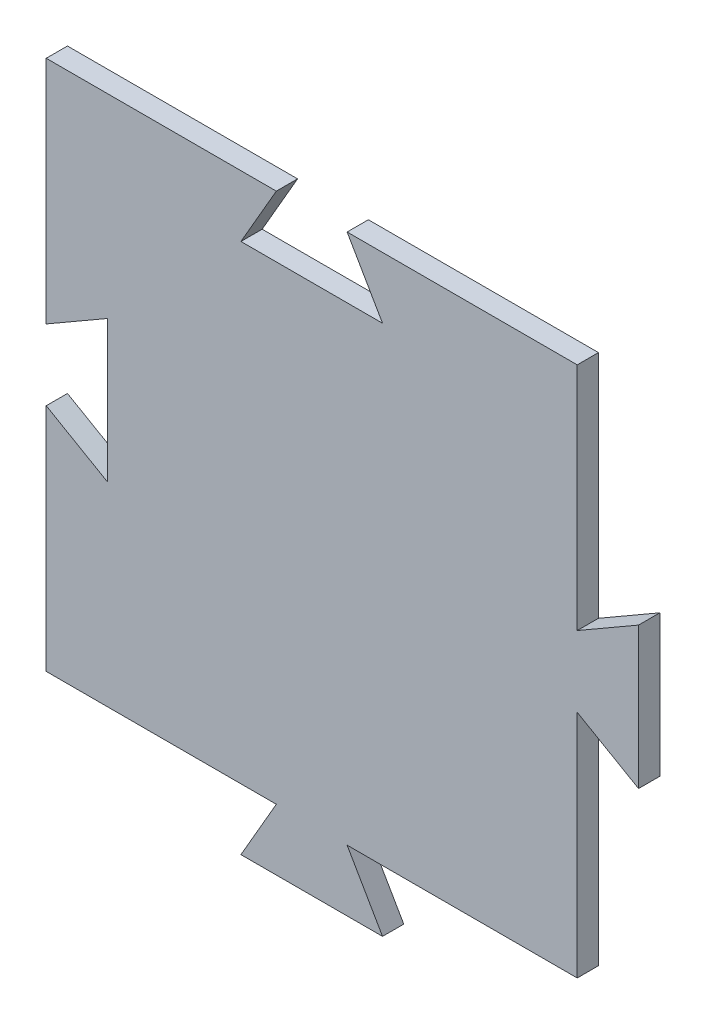
ISO-10303-21;
HEADER;
FILE_DESCRIPTION(('STEP AP214'),'2;1');
FILE_NAME('part.step','',(''),(''),'','','');
FILE_SCHEMA(('AUTOMOTIVE_DESIGN { 1 0 10303 214 1 1 1 1 }'));
ENDSEC;
DATA;
#1=APPLICATION_CONTEXT('core data for automotive mechanical design processes');
#2=APPLICATION_PROTOCOL_DEFINITION('international standard','automotive_design',2000,#1);
#3=PRODUCT_CONTEXT('',#1,'mechanical');
#4=PRODUCT('Part','Part','',(#3));
#5=PRODUCT_RELATED_PRODUCT_CATEGORY('part','',(#4));
#6=PRODUCT_DEFINITION_FORMATION('','',#4);
#7=PRODUCT_DEFINITION_CONTEXT('part definition',#1,'design');
#8=PRODUCT_DEFINITION('design','',#6,#7);
#9=PRODUCT_DEFINITION_SHAPE('','',#8);
#10=(LENGTH_UNIT() NAMED_UNIT(*) SI_UNIT(.MILLI.,.METRE.));
#11=(NAMED_UNIT(*) PLANE_ANGLE_UNIT() SI_UNIT($,.RADIAN.));
#12=(NAMED_UNIT(*) SI_UNIT($,.STERADIAN.) SOLID_ANGLE_UNIT());
#13=UNCERTAINTY_MEASURE_WITH_UNIT(LENGTH_MEASURE(1.E-05),#10,'distance_accuracy_value','');
#14=(GEOMETRIC_REPRESENTATION_CONTEXT(3) GLOBAL_UNCERTAINTY_ASSIGNED_CONTEXT((#13)) GLOBAL_UNIT_ASSIGNED_CONTEXT((#10,
#11,#12)) REPRESENTATION_CONTEXT('',''));
#15=CARTESIAN_POINT('',(0.,0.,0.));
#16=DIRECTION('',(0.,0.,1.));
#17=DIRECTION('',(1.,0.,0.));
#18=AXIS2_PLACEMENT_3D('',#15,#16,#17);
#19=CARTESIAN_POINT('',(-79.948093564893,-4.28788533096092,6.));
#20=DIRECTION('',(0.866025501337218,-0.499999831033593,0.));
#21=DIRECTION('',(0.499999831033593,0.866025501337218,0.));
#22=AXIS2_PLACEMENT_3D('',#19,#20,#21);
#23=PLANE('',#22);
#24=DIRECTION('',(-0.499999831033593,-0.866025501337217,0.));
#25=VECTOR('',#24,1.);
#26=CARTESIAN_POINT('',(-79.948093564893,-4.28788533096092,0.));
#27=LINE('',#26,#25);
#28=CARTESIAN_POINT('',(-79.948093564893,-4.28788533096092,0.));
#29=VERTEX_POINT('',#28);
#30=CARTESIAN_POINT('',(-89.9480901855649,-21.6083953577053,0.));
#31=VERTEX_POINT('',#30);
#32=EDGE_CURVE('E200',#29,#31,#27,.T.);
#33=ORIENTED_EDGE('',*,*,#32,.T.);
#34=DIRECTION('',(0.,0.,-1.));
#35=VECTOR('',#34,1.);
#36=CARTESIAN_POINT('',(-89.9480901855649,-21.6083953577053,6.));
#37=LINE('',#36,#35);
#38=CARTESIAN_POINT('',(-89.9480901855649,-21.6083953577053,6.));
#39=VERTEX_POINT('',#38);
#40=EDGE_CURVE('E11',#39,#31,#37,.T.);
#41=ORIENTED_EDGE('',*,*,#40,.F.);
#42=DIRECTION('',(-0.499999831033593,-0.866025501337217,0.));
#43=VECTOR('',#42,1.);
#44=CARTESIAN_POINT('',(-79.948093564893,-4.28788533096092,6.));
#45=LINE('',#44,#43);
#46=CARTESIAN_POINT('',(-79.948093564893,-4.28788533096092,6.));
#47=VERTEX_POINT('',#46);
#48=EDGE_CURVE('E238',#47,#39,#45,.T.);
#49=ORIENTED_EDGE('',*,*,#48,.F.);
#50=DIRECTION('',(0.,0.,-1.));
#51=VECTOR('',#50,1.);
#52=CARTESIAN_POINT('',(-79.948093564893,-4.28788533096092,6.));
#53=LINE('',#52,#51);
#54=EDGE_CURVE('E196',#47,#29,#53,.T.);
#55=ORIENTED_EDGE('',*,*,#54,.T.);
#56=EDGE_LOOP('',(#33,#41,#49,#55));
#57=FACE_BOUND('',#56,.T.);
#58=ADVANCED_FACE('F32',(#57),#23,.F.);
#59=CARTESIAN_POINT('',(-89.9480901855649,-21.6083953577053,6.));
#60=DIRECTION('',(0.,1.,0.));
#61=DIRECTION('',(0.,0.,1.));
#62=AXIS2_PLACEMENT_3D('',#59,#60,#61);
#63=PLANE('',#62);
#64=DIRECTION('',(1.,0.,0.));
#65=VECTOR('',#64,1.);
#66=CARTESIAN_POINT('',(-89.9480901855649,-21.6083953577053,0.));
#67=LINE('',#66,#65);
#68=CARTESIAN_POINT('',(-49.9480901855648,-21.6083953577053,0.));
#69=VERTEX_POINT('',#68);
#70=EDGE_CURVE('E203',#31,#69,#67,.T.);
#71=ORIENTED_EDGE('',*,*,#70,.T.);
#72=DIRECTION('',(0.,0.,-1.));
#73=VECTOR('',#72,1.);
#74=CARTESIAN_POINT('',(-49.9480901855648,-21.6083953577053,6.));
#75=LINE('',#74,#73);
#76=CARTESIAN_POINT('',(-49.9480901855648,-21.6083953577053,6.));
#77=VERTEX_POINT('',#76);
#78=EDGE_CURVE('E40',#77,#69,#75,.T.);
#79=ORIENTED_EDGE('',*,*,#78,.F.);
#80=DIRECTION('',(1.,0.,0.));
#81=VECTOR('',#80,1.);
#82=CARTESIAN_POINT('',(-89.9480901855649,-21.6083953577053,6.));
#83=LINE('',#82,#81);
#84=EDGE_CURVE('E127',#39,#77,#83,.T.);
#85=ORIENTED_EDGE('',*,*,#84,.F.);
#86=ORIENTED_EDGE('',*,*,#40,.T.);
#87=EDGE_LOOP('',(#71,#79,#85,#86));
#88=FACE_BOUND('',#87,.T.);
#89=ADVANCED_FACE('F356',(#88),#63,.F.);
#90=CARTESIAN_POINT('',(-49.9480901855648,-21.6083953577053,6.));
#91=DIRECTION('',(-0.866025306231598,-0.500000168966438,0.));
#92=DIRECTION('',(0.500000168966438,-0.866025306231599,0.));
#93=AXIS2_PLACEMENT_3D('',#90,#91,#92);
#94=PLANE('',#93);
#95=DIRECTION('',(-0.500000168966438,0.866025306231598,0.));
#96=VECTOR('',#95,1.);
#97=CARTESIAN_POINT('',(-49.9480901855648,-21.6083953577053,0.));
#98=LINE('',#97,#96);
#99=CARTESIAN_POINT('',(-59.9480935648936,-4.28788923307331,0.));
#100=VERTEX_POINT('',#99);
#101=EDGE_CURVE('E205',#69,#100,#98,.T.);
#102=ORIENTED_EDGE('',*,*,#101,.T.);
#103=DIRECTION('',(0.,0.,-1.));
#104=VECTOR('',#103,1.);
#105=CARTESIAN_POINT('',(-59.9480935648936,-4.28788923307331,6.));
#106=LINE('',#105,#104);
#107=CARTESIAN_POINT('',(-59.9480935648936,-4.28788923307331,6.));
#108=VERTEX_POINT('',#107);
#109=EDGE_CURVE('E281',#108,#100,#106,.T.);
#110=ORIENTED_EDGE('',*,*,#109,.F.);
#111=DIRECTION('',(-0.500000168966438,0.866025306231598,0.));
#112=VECTOR('',#111,1.);
#113=CARTESIAN_POINT('',(-49.9480901855648,-21.6083953577053,6.));
#114=LINE('',#113,#112);
#115=EDGE_CURVE('E289',#77,#108,#114,.T.);
#116=ORIENTED_EDGE('',*,*,#115,.F.);
#117=ORIENTED_EDGE('',*,*,#78,.T.);
#118=EDGE_LOOP('',(#102,#110,#116,#117));
#119=FACE_BOUND('',#118,.T.);
#120=ADVANCED_FACE('F287',(#119),#94,.F.);
#121=CARTESIAN_POINT('',(-59.9480935648936,-4.28788923307331,6.));
#122=DIRECTION('',(0.,1.,0.));
#123=DIRECTION('',(0.,0.,1.));
#124=AXIS2_PLACEMENT_3D('',#121,#122,#123);
#125=PLANE('',#124);
#126=DIRECTION('',(1.,0.,0.));
#127=VECTOR('',#126,1.);
#128=CARTESIAN_POINT('',(-59.9480935648936,-4.28788923307331,0.));
#129=LINE('',#128,#127);
#130=CARTESIAN_POINT('',(5.05190643510641,-4.28788923307331,0.));
#131=VERTEX_POINT('',#130);
#132=EDGE_CURVE('E207',#100,#131,#129,.T.);
#133=ORIENTED_EDGE('',*,*,#132,.T.);
#134=DIRECTION('',(0.,0.,-1.));
#135=VECTOR('',#134,1.);
#136=CARTESIAN_POINT('',(5.05190643510641,-4.28788923307331,6.));
#137=LINE('',#136,#135);
#138=CARTESIAN_POINT('',(5.05190643510641,-4.28788923307331,6.));
#139=VERTEX_POINT('',#138);
#140=EDGE_CURVE('E278',#139,#131,#137,.T.);
#141=ORIENTED_EDGE('',*,*,#140,.F.);
#142=DIRECTION('',(1.,0.,0.));
#143=VECTOR('',#142,1.);
#144=CARTESIAN_POINT('',(-59.9480935648936,-4.28788923307331,6.));
#145=LINE('',#144,#143);
#146=EDGE_CURVE('E307',#108,#139,#145,.T.);
#147=ORIENTED_EDGE('',*,*,#146,.F.);
#148=ORIENTED_EDGE('',*,*,#109,.T.);
#149=EDGE_LOOP('',(#133,#141,#147,#148));
#150=FACE_BOUND('',#149,.T.);
#151=ADVANCED_FACE('F298',(#150),#125,.F.);
#152=CARTESIAN_POINT('',(5.05190643510641,-4.28788923307331,6.));
#153=DIRECTION('',(-1.,0.,0.));
#154=DIRECTION('',(0.,-1.,0.));
#155=AXIS2_PLACEMENT_3D('',#152,#153,#154);
#156=PLANE('',#155);
#157=DIRECTION('',(0.,1.,0.));
#158=VECTOR('',#157,1.);
#159=CARTESIAN_POINT('',(5.05190643510641,-4.28788923307331,0.));
#160=LINE('',#159,#158);
#161=CARTESIAN_POINT('',(5.0519064351064,60.7121107669267,0.));
#162=VERTEX_POINT('',#161);
#163=EDGE_CURVE('E209',#131,#162,#160,.T.);
#164=ORIENTED_EDGE('',*,*,#163,.T.);
#165=DIRECTION('',(0.,0.,-1.));
#166=VECTOR('',#165,1.);
#167=CARTESIAN_POINT('',(5.0519064351064,60.7121107669267,6.));
#168=LINE('',#167,#166);
#169=CARTESIAN_POINT('',(5.0519064351064,60.7121107669267,6.));
#170=VERTEX_POINT('',#169);
#171=EDGE_CURVE('E275',#170,#162,#168,.T.);
#172=ORIENTED_EDGE('',*,*,#171,.F.);
#173=DIRECTION('',(0.,1.,0.));
#174=VECTOR('',#173,1.);
#175=CARTESIAN_POINT('',(5.05190643510641,-4.28788923307331,6.));
#176=LINE('',#175,#174);
#177=EDGE_CURVE('E304',#139,#170,#176,.T.);
#178=ORIENTED_EDGE('',*,*,#177,.F.);
#179=ORIENTED_EDGE('',*,*,#140,.T.);
#180=EDGE_LOOP('',(#164,#172,#178,#179));
#181=FACE_BOUND('',#180,.T.);
#182=ADVANCED_FACE('F302',(#181),#156,.F.);
#183=CARTESIAN_POINT('',(5.0519064351064,60.7121107669267,6.));
#184=DIRECTION('',(0.499999831033581,0.866025501337224,0.));
#185=DIRECTION('',(-0.866025501337224,0.499999831033581,0.));
#186=AXIS2_PLACEMENT_3D('',#183,#184,#185);
#187=PLANE('',#186);
#188=DIRECTION('',(0.866025501337224,-0.499999831033581,0.));
#189=VECTOR('',#188,1.);
#190=CARTESIAN_POINT('',(5.0519064351064,60.7121107669267,0.));
#191=LINE('',#190,#189);
#192=CARTESIAN_POINT('',(22.3724164618509,50.7121141462551,0.));
#193=VERTEX_POINT('',#192);
#194=EDGE_CURVE('E211',#162,#193,#191,.T.);
#195=ORIENTED_EDGE('',*,*,#194,.T.);
#196=DIRECTION('',(0.,0.,-1.));
#197=VECTOR('',#196,1.);
#198=CARTESIAN_POINT('',(22.3724164618509,50.7121141462551,6.));
#199=LINE('',#198,#197);
#200=CARTESIAN_POINT('',(22.3724164618509,50.7121141462551,6.));
#201=VERTEX_POINT('',#200);
#202=EDGE_CURVE('E272',#201,#193,#199,.T.);
#203=ORIENTED_EDGE('',*,*,#202,.F.);
#204=DIRECTION('',(0.866025501337224,-0.499999831033581,0.));
#205=VECTOR('',#204,1.);
#206=CARTESIAN_POINT('',(5.0519064351064,60.7121107669267,6.));
#207=LINE('',#206,#205);
#208=EDGE_CURVE('E306',#170,#201,#207,.T.);
#209=ORIENTED_EDGE('',*,*,#208,.F.);
#210=ORIENTED_EDGE('',*,*,#171,.T.);
#211=EDGE_LOOP('',(#195,#203,#209,#210));
#212=FACE_BOUND('',#211,.T.);
#213=ADVANCED_FACE('F369',(#212),#187,.F.);
#214=CARTESIAN_POINT('',(22.3724164618509,50.7121141462551,6.));
#215=DIRECTION('',(-1.,0.,0.));
#216=DIRECTION('',(0.,0.,1.));
#217=AXIS2_PLACEMENT_3D('',#214,#215,#216);
#218=PLANE('',#217);
#219=DIRECTION('',(0.,1.,0.));
#220=VECTOR('',#219,1.);
#221=CARTESIAN_POINT('',(22.3724164618509,50.7121141462551,0.));
#222=LINE('',#221,#220);
#223=CARTESIAN_POINT('',(22.3724164618509,90.7121141462551,0.));
#224=VERTEX_POINT('',#223);
#225=EDGE_CURVE('E213',#193,#224,#222,.T.);
#226=ORIENTED_EDGE('',*,*,#225,.T.);
#227=DIRECTION('',(0.,0.,-1.));
#228=VECTOR('',#227,1.);
#229=CARTESIAN_POINT('',(22.3724164618509,90.7121141462551,6.));
#230=LINE('',#229,#228);
#231=CARTESIAN_POINT('',(22.3724164618509,90.7121141462551,6.));
#232=VERTEX_POINT('',#231);
#233=EDGE_CURVE('E269',#232,#224,#230,.T.);
#234=ORIENTED_EDGE('',*,*,#233,.F.);
#235=DIRECTION('',(0.,1.,0.));
#236=VECTOR('',#235,1.);
#237=CARTESIAN_POINT('',(22.3724164618509,50.7121141462551,6.));
#238=LINE('',#237,#236);
#239=EDGE_CURVE('E309',#201,#232,#238,.T.);
#240=ORIENTED_EDGE('',*,*,#239,.F.);
#241=ORIENTED_EDGE('',*,*,#202,.T.);
#242=EDGE_LOOP('',(#226,#234,#240,#241));
#243=FACE_BOUND('',#242,.T.);
#244=ADVANCED_FACE('F372',(#243),#218,.F.);
#245=CARTESIAN_POINT('',(22.3724164618509,90.7121141462551,6.));
#246=DIRECTION('',(0.500000168966438,-0.866025306231598,0.));
#247=DIRECTION('',(0.866025306231598,0.500000168966438,0.));
#248=AXIS2_PLACEMENT_3D('',#245,#246,#247);
#249=PLANE('',#248);
#250=DIRECTION('',(-0.866025306231598,-0.500000168966438,0.));
#251=VECTOR('',#250,1.);
#252=CARTESIAN_POINT('',(22.3724164618509,90.7121141462551,0.));
#253=LINE('',#252,#251);
#254=CARTESIAN_POINT('',(5.05191033721893,80.7121107669263,0.));
#255=VERTEX_POINT('',#254);
#256=EDGE_CURVE('E215',#224,#255,#253,.T.);
#257=ORIENTED_EDGE('',*,*,#256,.T.);
#258=DIRECTION('',(0.,0.,-1.));
#259=VECTOR('',#258,1.);
#260=CARTESIAN_POINT('',(5.05191033721893,80.7121107669263,6.));
#261=LINE('',#260,#259);
#262=CARTESIAN_POINT('',(5.05191033721893,80.7121107669263,6.));
#263=VERTEX_POINT('',#262);
#264=EDGE_CURVE('E266',#263,#255,#261,.T.);
#265=ORIENTED_EDGE('',*,*,#264,.F.);
#266=DIRECTION('',(-0.866025306231598,-0.500000168966438,0.));
#267=VECTOR('',#266,1.);
#268=CARTESIAN_POINT('',(22.3724164618509,90.7121141462551,6.));
#269=LINE('',#268,#267);
#270=EDGE_CURVE('E315',#232,#263,#269,.T.);
#271=ORIENTED_EDGE('',*,*,#270,.F.);
#272=ORIENTED_EDGE('',*,*,#233,.T.);
#273=EDGE_LOOP('',(#257,#265,#271,#272));
#274=FACE_BOUND('',#273,.T.);
#275=ADVANCED_FACE('F376',(#274),#249,.F.);
#276=CARTESIAN_POINT('',(5.05191033721893,80.7121107669263,6.));
#277=DIRECTION('',(-1.,0.,0.));
#278=DIRECTION('',(0.,0.,1.));
#279=AXIS2_PLACEMENT_3D('',#276,#277,#278);
#280=PLANE('',#279);
#281=DIRECTION('',(0.,1.,0.));
#282=VECTOR('',#281,1.);
#283=CARTESIAN_POINT('',(5.05191033721893,80.7121107669263,0.));
#284=LINE('',#283,#282);
#285=CARTESIAN_POINT('',(5.05191033721893,145.712110766926,0.));
#286=VERTEX_POINT('',#285);
#287=EDGE_CURVE('E217',#255,#286,#284,.T.);
#288=ORIENTED_EDGE('',*,*,#287,.T.);
#289=DIRECTION('',(0.,0.,-1.));
#290=VECTOR('',#289,1.);
#291=CARTESIAN_POINT('',(5.05191033721893,145.712110766926,6.));
#292=LINE('',#291,#290);
#293=CARTESIAN_POINT('',(5.05191033721893,145.712110766926,6.));
#294=VERTEX_POINT('',#293);
#295=EDGE_CURVE('E263',#294,#286,#292,.T.);
#296=ORIENTED_EDGE('',*,*,#295,.F.);
#297=DIRECTION('',(0.,1.,0.));
#298=VECTOR('',#297,1.);
#299=CARTESIAN_POINT('',(5.05191033721893,80.7121107669263,6.));
#300=LINE('',#299,#298);
#301=EDGE_CURVE('E317',#263,#294,#300,.T.);
#302=ORIENTED_EDGE('',*,*,#301,.F.);
#303=ORIENTED_EDGE('',*,*,#264,.T.);
#304=EDGE_LOOP('',(#288,#296,#302,#303));
#305=FACE_BOUND('',#304,.T.);
#306=ADVANCED_FACE('F380',(#305),#280,.F.);
#307=CARTESIAN_POINT('',(5.05191033721893,145.712110766926,6.));
#308=DIRECTION('',(0.,-1.,0.));
#309=DIRECTION('',(0.,0.,-1.));
#310=AXIS2_PLACEMENT_3D('',#307,#308,#309);
#311=PLANE('',#310);
#312=DIRECTION('',(-1.,0.,0.));
#313=VECTOR('',#312,1.);
#314=CARTESIAN_POINT('',(5.05191033721893,145.712110766926,0.));
#315=LINE('',#314,#313);
#316=CARTESIAN_POINT('',(-59.9480896627811,145.712110766926,0.));
#317=VERTEX_POINT('',#316);
#318=EDGE_CURVE('E219',#286,#317,#315,.T.);
#319=ORIENTED_EDGE('',*,*,#318,.T.);
#320=DIRECTION('',(0.,0.,-1.));
#321=VECTOR('',#320,1.);
#322=CARTESIAN_POINT('',(-59.9480896627811,145.712110766926,6.));
#323=LINE('',#322,#321);
#324=CARTESIAN_POINT('',(-59.9480896627811,145.712110766926,6.));
#325=VERTEX_POINT('',#324);
#326=EDGE_CURVE('E260',#325,#317,#323,.T.);
#327=ORIENTED_EDGE('',*,*,#326,.F.);
#328=DIRECTION('',(-1.,0.,0.));
#329=VECTOR('',#328,1.);
#330=CARTESIAN_POINT('',(5.05191033721893,145.712110766926,6.));
#331=LINE('',#330,#329);
#332=EDGE_CURVE('E319',#294,#325,#331,.T.);
#333=ORIENTED_EDGE('',*,*,#332,.F.);
#334=ORIENTED_EDGE('',*,*,#295,.T.);
#335=EDGE_LOOP('',(#319,#327,#333,#334));
#336=FACE_BOUND('',#335,.T.);
#337=ADVANCED_FACE('F384',(#336),#311,.F.);
#338=CARTESIAN_POINT('',(-59.9480896627811,145.712110766926,6.));
#339=DIRECTION('',(0.866025306231598,0.500000168966438,0.));
#340=DIRECTION('',(-0.500000168966438,0.866025306231598,0.));
#341=AXIS2_PLACEMENT_3D('',#338,#339,#340);
#342=PLANE('',#341);
#343=DIRECTION('',(0.500000168966438,-0.866025306231598,0.));
#344=VECTOR('',#343,1.);
#345=CARTESIAN_POINT('',(-59.9480896627811,145.712110766926,0.));
#346=LINE('',#345,#344);
#347=CARTESIAN_POINT('',(-49.9480862834523,128.391604642294,0.));
#348=VERTEX_POINT('',#347);
#349=EDGE_CURVE('E221',#317,#348,#346,.T.);
#350=ORIENTED_EDGE('',*,*,#349,.T.);
#351=DIRECTION('',(0.,0.,-1.));
#352=VECTOR('',#351,1.);
#353=CARTESIAN_POINT('',(-49.9480862834523,128.391604642294,6.));
#354=LINE('',#353,#352);
#355=CARTESIAN_POINT('',(-49.9480862834523,128.391604642294,6.));
#356=VERTEX_POINT('',#355);
#357=EDGE_CURVE('E257',#356,#348,#354,.T.);
#358=ORIENTED_EDGE('',*,*,#357,.F.);
#359=DIRECTION('',(0.500000168966438,-0.866025306231598,0.));
#360=VECTOR('',#359,1.);
#361=CARTESIAN_POINT('',(-59.9480896627811,145.712110766926,6.));
#362=LINE('',#361,#360);
#363=EDGE_CURVE('E321',#325,#356,#362,.T.);
#364=ORIENTED_EDGE('',*,*,#363,.F.);
#365=ORIENTED_EDGE('',*,*,#326,.T.);
#366=EDGE_LOOP('',(#350,#358,#364,#365));
#367=FACE_BOUND('',#366,.T.);
#368=ADVANCED_FACE('F388',(#367),#342,.F.);
#369=CARTESIAN_POINT('',(-49.9480862834523,128.391604642294,6.));
#370=DIRECTION('',(0.,-1.,0.));
#371=DIRECTION('',(0.,0.,-1.));
#372=AXIS2_PLACEMENT_3D('',#369,#370,#371);
#373=PLANE('',#372);
#374=DIRECTION('',(-1.,0.,0.));
#375=VECTOR('',#374,1.);
#376=CARTESIAN_POINT('',(-49.9480862834523,128.391604642294,0.));
#377=LINE('',#376,#375);
#378=CARTESIAN_POINT('',(-89.9480862834523,128.391604642294,0.));
#379=VERTEX_POINT('',#378);
#380=EDGE_CURVE('E223',#348,#379,#377,.T.);
#381=ORIENTED_EDGE('',*,*,#380,.T.);
#382=DIRECTION('',(0.,0.,-1.));
#383=VECTOR('',#382,1.);
#384=CARTESIAN_POINT('',(-89.9480862834523,128.391604642294,6.));
#385=LINE('',#384,#383);
#386=CARTESIAN_POINT('',(-89.9480862834523,128.391604642294,6.));
#387=VERTEX_POINT('',#386);
#388=EDGE_CURVE('E254',#387,#379,#385,.T.);
#389=ORIENTED_EDGE('',*,*,#388,.F.);
#390=DIRECTION('',(-1.,0.,0.));
#391=VECTOR('',#390,1.);
#392=CARTESIAN_POINT('',(-49.9480862834523,128.391604642294,6.));
#393=LINE('',#392,#391);
#394=EDGE_CURVE('E323',#356,#387,#393,.T.);
#395=ORIENTED_EDGE('',*,*,#394,.F.);
#396=ORIENTED_EDGE('',*,*,#357,.T.);
#397=EDGE_LOOP('',(#381,#389,#395,#396));
#398=FACE_BOUND('',#397,.T.);
#399=ADVANCED_FACE('F392',(#398),#373,.F.);
#400=CARTESIAN_POINT('',(-89.9480862834523,128.391604642294,6.));
#401=DIRECTION('',(-0.866025501337225,0.49999983103358,0.));
#402=DIRECTION('',(-0.49999983103358,-0.866025501337225,0.));
#403=AXIS2_PLACEMENT_3D('',#400,#401,#402);
#404=PLANE('',#403);
#405=DIRECTION('',(0.49999983103358,0.866025501337225,0.));
#406=VECTOR('',#405,1.);
#407=CARTESIAN_POINT('',(-89.9480862834523,128.391604642294,0.));
#408=LINE('',#407,#406);
#409=CARTESIAN_POINT('',(-79.9480896627807,145.712114669039,0.));
#410=VERTEX_POINT('',#409);
#411=EDGE_CURVE('E225',#379,#410,#408,.T.);
#412=ORIENTED_EDGE('',*,*,#411,.T.);
#413=DIRECTION('',(0.,0.,-1.));
#414=VECTOR('',#413,1.);
#415=CARTESIAN_POINT('',(-79.9480896627807,145.712114669039,6.));
#416=LINE('',#415,#414);
#417=CARTESIAN_POINT('',(-79.9480896627807,145.712114669039,6.));
#418=VERTEX_POINT('',#417);
#419=EDGE_CURVE('E251',#418,#410,#416,.T.);
#420=ORIENTED_EDGE('',*,*,#419,.F.);
#421=DIRECTION('',(0.49999983103358,0.866025501337225,0.));
#422=VECTOR('',#421,1.);
#423=CARTESIAN_POINT('',(-89.9480862834523,128.391604642294,6.));
#424=LINE('',#423,#422);
#425=EDGE_CURVE('E325',#387,#418,#424,.T.);
#426=ORIENTED_EDGE('',*,*,#425,.F.);
#427=ORIENTED_EDGE('',*,*,#388,.T.);
#428=EDGE_LOOP('',(#412,#420,#426,#427));
#429=FACE_BOUND('',#428,.T.);
#430=ADVANCED_FACE('F396',(#429),#404,.F.);
#431=CARTESIAN_POINT('',(-79.9480896627807,145.712114669039,6.));
#432=DIRECTION('',(0.,-1.,0.));
#433=DIRECTION('',(0.,0.,-1.));
#434=AXIS2_PLACEMENT_3D('',#431,#432,#433);
#435=PLANE('',#434);
#436=DIRECTION('',(-1.,0.,0.));
#437=VECTOR('',#436,1.);
#438=CARTESIAN_POINT('',(-79.9480896627807,145.712114669039,0.));
#439=LINE('',#438,#437);
#440=CARTESIAN_POINT('',(-144.948089662781,145.712114669039,0.));
#441=VERTEX_POINT('',#440);
#442=EDGE_CURVE('E227',#410,#441,#439,.T.);
#443=ORIENTED_EDGE('',*,*,#442,.T.);
#444=DIRECTION('',(0.,0.,-1.));
#445=VECTOR('',#444,1.);
#446=CARTESIAN_POINT('',(-144.948089662781,145.712114669039,6.));
#447=LINE('',#446,#445);
#448=CARTESIAN_POINT('',(-144.948089662781,145.712114669039,6.));
#449=VERTEX_POINT('',#448);
#450=EDGE_CURVE('E248',#449,#441,#447,.T.);
#451=ORIENTED_EDGE('',*,*,#450,.F.);
#452=DIRECTION('',(-1.,0.,0.));
#453=VECTOR('',#452,1.);
#454=CARTESIAN_POINT('',(-79.9480896627807,145.712114669039,6.));
#455=LINE('',#454,#453);
#456=EDGE_CURVE('E327',#418,#449,#455,.T.);
#457=ORIENTED_EDGE('',*,*,#456,.F.);
#458=ORIENTED_EDGE('',*,*,#419,.T.);
#459=EDGE_LOOP('',(#443,#451,#457,#458));
#460=FACE_BOUND('',#459,.T.);
#461=ADVANCED_FACE('F400',(#460),#435,.F.);
#462=CARTESIAN_POINT('',(-144.948089662781,145.712114669039,6.));
#463=DIRECTION('',(1.,0.,0.));
#464=DIRECTION('',(0.,0.,-1.));
#465=AXIS2_PLACEMENT_3D('',#462,#463,#464);
#466=PLANE('',#465);
#467=DIRECTION('',(0.,-1.,0.));
#468=VECTOR('',#467,1.);
#469=CARTESIAN_POINT('',(-144.948089662781,145.712114669039,0.));
#470=LINE('',#469,#468);
#471=CARTESIAN_POINT('',(-144.948089662781,80.7121146690388,0.));
#472=VERTEX_POINT('',#471);
#473=EDGE_CURVE('E229',#441,#472,#470,.T.);
#474=ORIENTED_EDGE('',*,*,#473,.T.);
#475=DIRECTION('',(0.,0.,-1.));
#476=VECTOR('',#475,1.);
#477=CARTESIAN_POINT('',(-144.948089662781,80.7121146690388,6.));
#478=LINE('',#477,#476);
#479=CARTESIAN_POINT('',(-144.948089662781,80.7121146690388,6.));
#480=VERTEX_POINT('',#479);
#481=EDGE_CURVE('E245',#480,#472,#478,.T.);
#482=ORIENTED_EDGE('',*,*,#481,.F.);
#483=DIRECTION('',(0.,-1.,0.));
#484=VECTOR('',#483,1.);
#485=CARTESIAN_POINT('',(-144.948089662781,145.712114669039,6.));
#486=LINE('',#485,#484);
#487=EDGE_CURVE('E329',#449,#480,#486,.T.);
#488=ORIENTED_EDGE('',*,*,#487,.F.);
#489=ORIENTED_EDGE('',*,*,#450,.T.);
#490=EDGE_LOOP('',(#474,#482,#488,#489));
#491=FACE_BOUND('',#490,.T.);
#492=ADVANCED_FACE('F404',(#491),#466,.F.);
#493=CARTESIAN_POINT('',(-144.948089662781,80.7121146690388,6.));
#494=DIRECTION('',(-0.500000168966419,0.866025306231609,0.));
#495=DIRECTION('',(-0.866025306231609,-0.500000168966419,0.));
#496=AXIS2_PLACEMENT_3D('',#493,#494,#495);
#497=PLANE('',#496);
#498=DIRECTION('',(0.866025306231609,0.500000168966419,0.));
#499=VECTOR('',#498,1.);
#500=CARTESIAN_POINT('',(-144.948089662781,80.7121146690388,0.));
#501=LINE('',#500,#499);
#502=CARTESIAN_POINT('',(-127.627583538149,90.7121180483672,0.));
#503=VERTEX_POINT('',#502);
#504=EDGE_CURVE('E231',#472,#503,#501,.T.);
#505=ORIENTED_EDGE('',*,*,#504,.T.);
#506=DIRECTION('',(0.,0.,-1.));
#507=VECTOR('',#506,1.);
#508=CARTESIAN_POINT('',(-127.627583538149,90.7121180483672,6.));
#509=LINE('',#508,#507);
#510=CARTESIAN_POINT('',(-127.627583538149,90.7121180483672,6.));
#511=VERTEX_POINT('',#510);
#512=EDGE_CURVE('E242',#511,#503,#509,.T.);
#513=ORIENTED_EDGE('',*,*,#512,.F.);
#514=DIRECTION('',(0.866025306231609,0.500000168966419,0.));
#515=VECTOR('',#514,1.);
#516=CARTESIAN_POINT('',(-144.948089662781,80.7121146690388,6.));
#517=LINE('',#516,#515);
#518=EDGE_CURVE('E331',#480,#511,#517,.T.);
#519=ORIENTED_EDGE('',*,*,#518,.F.);
#520=ORIENTED_EDGE('',*,*,#481,.T.);
#521=EDGE_LOOP('',(#505,#513,#519,#520));
#522=FACE_BOUND('',#521,.T.);
#523=ADVANCED_FACE('F337',(#522),#497,.F.);
#524=CARTESIAN_POINT('',(-127.627583538149,90.7121180483672,6.));
#525=DIRECTION('',(1.,0.,0.));
#526=DIRECTION('',(0.,0.,-1.));
#527=AXIS2_PLACEMENT_3D('',#524,#525,#526);
#528=PLANE('',#527);
#529=DIRECTION('',(0.,-1.,0.));
#530=VECTOR('',#529,1.);
#531=CARTESIAN_POINT('',(-127.627583538149,90.7121180483672,0.));
#532=LINE('',#531,#530);
#533=CARTESIAN_POINT('',(-127.627583538149,50.7121180483672,0.));
#534=VERTEX_POINT('',#533);
#535=EDGE_CURVE('E233',#503,#534,#532,.T.);
#536=ORIENTED_EDGE('',*,*,#535,.T.);
#537=DIRECTION('',(0.,0.,-1.));
#538=VECTOR('',#537,1.);
#539=CARTESIAN_POINT('',(-127.627583538149,50.7121180483672,6.));
#540=LINE('',#539,#538);
#541=CARTESIAN_POINT('',(-127.627583538149,50.7121180483672,6.));
#542=VERTEX_POINT('',#541);
#543=EDGE_CURVE('E191',#542,#534,#540,.T.);
#544=ORIENTED_EDGE('',*,*,#543,.F.);
#545=DIRECTION('',(0.,-1.,0.));
#546=VECTOR('',#545,1.);
#547=CARTESIAN_POINT('',(-127.627583538149,90.7121180483672,6.));
#548=LINE('',#547,#546);
#549=EDGE_CURVE('E182',#511,#542,#548,.T.);
#550=ORIENTED_EDGE('',*,*,#549,.F.);
#551=ORIENTED_EDGE('',*,*,#512,.T.);
#552=EDGE_LOOP('',(#536,#544,#550,#551));
#553=FACE_BOUND('',#552,.T.);
#554=ADVANCED_FACE('F341',(#553),#528,.F.);
#555=CARTESIAN_POINT('',(-127.627583538149,50.7121180483672,6.));
#556=DIRECTION('',(-0.499999831033581,-0.866025501337224,0.));
#557=DIRECTION('',(0.866025501337224,-0.499999831033581,0.));
#558=AXIS2_PLACEMENT_3D('',#555,#556,#557);
#559=PLANE('',#558);
#560=DIRECTION('',(-0.866025501337224,0.499999831033581,0.));
#561=VECTOR('',#560,1.);
#562=CARTESIAN_POINT('',(-127.627583538149,50.7121180483672,0.));
#563=LINE('',#562,#561);
#564=CARTESIAN_POINT('',(-144.948093564893,60.7121146690388,0.));
#565=VERTEX_POINT('',#564);
#566=EDGE_CURVE('E190',#534,#565,#563,.T.);
#567=ORIENTED_EDGE('',*,*,#566,.T.);
#568=DIRECTION('',(0.,0.,-1.));
#569=VECTOR('',#568,1.);
#570=CARTESIAN_POINT('',(-144.948093564893,60.7121146690388,6.));
#571=LINE('',#570,#569);
#572=CARTESIAN_POINT('',(-144.948093564893,60.7121146690388,6.));
#573=VERTEX_POINT('',#572);
#574=EDGE_CURVE('E187',#573,#565,#571,.T.);
#575=ORIENTED_EDGE('',*,*,#574,.F.);
#576=DIRECTION('',(-0.866025501337224,0.499999831033581,0.));
#577=VECTOR('',#576,1.);
#578=CARTESIAN_POINT('',(-127.627583538149,50.7121180483672,6.));
#579=LINE('',#578,#577);
#580=EDGE_CURVE('E176',#542,#573,#579,.T.);
#581=ORIENTED_EDGE('',*,*,#580,.F.);
#582=ORIENTED_EDGE('',*,*,#543,.T.);
#583=EDGE_LOOP('',(#567,#575,#581,#582));
#584=FACE_BOUND('',#583,.T.);
#585=ADVANCED_FACE('F188',(#584),#559,.F.);
#586=CARTESIAN_POINT('',(-144.948093564893,60.7121146690388,6.));
#587=DIRECTION('',(1.,0.,0.));
#588=DIRECTION('',(0.,0.,-1.));
#589=AXIS2_PLACEMENT_3D('',#586,#587,#588);
#590=PLANE('',#589);
#591=DIRECTION('',(0.,-1.,0.));
#592=VECTOR('',#591,1.);
#593=CARTESIAN_POINT('',(-144.948093564893,60.7121146690388,0.));
#594=LINE('',#593,#592);
#595=CARTESIAN_POINT('',(-144.948093564893,-4.28788533096116,0.));
#596=VERTEX_POINT('',#595);
#597=EDGE_CURVE('E113',#565,#596,#594,.T.);
#598=ORIENTED_EDGE('',*,*,#597,.T.);
#599=DIRECTION('',(0.,0.,-1.));
#600=VECTOR('',#599,1.);
#601=CARTESIAN_POINT('',(-144.948093564893,-4.28788533096116,6.));
#602=LINE('',#601,#600);
#603=CARTESIAN_POINT('',(-144.948093564893,-4.28788533096116,6.));
#604=VERTEX_POINT('',#603);
#605=EDGE_CURVE('E192',#604,#596,#602,.T.);
#606=ORIENTED_EDGE('',*,*,#605,.F.);
#607=DIRECTION('',(0.,-1.,0.));
#608=VECTOR('',#607,1.);
#609=CARTESIAN_POINT('',(-144.948093564893,60.7121146690388,6.));
#610=LINE('',#609,#608);
#611=EDGE_CURVE('E180',#573,#604,#610,.T.);
#612=ORIENTED_EDGE('',*,*,#611,.F.);
#613=ORIENTED_EDGE('',*,*,#574,.T.);
#614=EDGE_LOOP('',(#598,#606,#612,#613));
#615=FACE_BOUND('',#614,.T.);
#616=ADVANCED_FACE('F194',(#615),#590,.F.);
#617=CARTESIAN_POINT('',(-144.948093564893,-4.28788533096116,6.));
#618=DIRECTION('',(0.,1.,0.));
#619=DIRECTION('',(-1.,0.,0.));
#620=AXIS2_PLACEMENT_3D('',#617,#618,#619);
#621=PLANE('',#620);
#622=DIRECTION('',(1.,0.,0.));
#623=VECTOR('',#622,1.);
#624=CARTESIAN_POINT('',(-144.948093564893,-4.28788533096116,0.));
#625=LINE('',#624,#623);
#626=EDGE_CURVE('E119',#596,#29,#625,.T.);
#627=ORIENTED_EDGE('',*,*,#626,.T.);
#628=ORIENTED_EDGE('',*,*,#54,.F.);
#629=DIRECTION('',(1.,0.,0.));
#630=VECTOR('',#629,1.);
#631=CARTESIAN_POINT('',(-144.948093564893,-4.28788533096116,6.));
#632=LINE('',#631,#630);
#633=EDGE_CURVE('E48',#604,#47,#632,.T.);
#634=ORIENTED_EDGE('',*,*,#633,.F.);
#635=ORIENTED_EDGE('',*,*,#605,.T.);
#636=EDGE_LOOP('',(#627,#628,#634,#635));
#637=FACE_BOUND('',#636,.T.);
#638=ADVANCED_FACE('F345',(#637),#621,.F.);
#639=CARTESIAN_POINT('',(0.,0.,6.));
#640=DIRECTION('',(0.,0.,1.));
#641=DIRECTION('',(1.,0.,0.));
#642=AXIS2_PLACEMENT_3D('',#639,#640,#641);
#643=PLANE('',#642);
#644=ORIENTED_EDGE('',*,*,#48,.T.);
#645=ORIENTED_EDGE('',*,*,#84,.T.);
#646=ORIENTED_EDGE('',*,*,#115,.T.);
#647=ORIENTED_EDGE('',*,*,#146,.T.);
#648=ORIENTED_EDGE('',*,*,#177,.T.);
#649=ORIENTED_EDGE('',*,*,#208,.T.);
#650=ORIENTED_EDGE('',*,*,#239,.T.);
#651=ORIENTED_EDGE('',*,*,#270,.T.);
#652=ORIENTED_EDGE('',*,*,#301,.T.);
#653=ORIENTED_EDGE('',*,*,#332,.T.);
#654=ORIENTED_EDGE('',*,*,#363,.T.);
#655=ORIENTED_EDGE('',*,*,#394,.T.);
#656=ORIENTED_EDGE('',*,*,#425,.T.);
#657=ORIENTED_EDGE('',*,*,#456,.T.);
#658=ORIENTED_EDGE('',*,*,#487,.T.);
#659=ORIENTED_EDGE('',*,*,#518,.T.);
#660=ORIENTED_EDGE('',*,*,#549,.T.);
#661=ORIENTED_EDGE('',*,*,#580,.T.);
#662=ORIENTED_EDGE('',*,*,#611,.T.);
#663=ORIENTED_EDGE('',*,*,#633,.T.);
#664=EDGE_LOOP('',(#644,#645,#646,#647,#648,#649,#650,#651,#652,#653,#654,#655,#656,#657,#658,
#659,#660,#661,#662,#663));
#665=FACE_BOUND('',#664,.T.);
#666=ADVANCED_FACE('F178',(#665),#643,.T.);
#667=CARTESIAN_POINT('',(0.,0.,0.));
#668=DIRECTION('',(0.,0.,1.));
#669=DIRECTION('',(1.,0.,0.));
#670=AXIS2_PLACEMENT_3D('',#667,#668,#669);
#671=PLANE('',#670);
#672=ORIENTED_EDGE('',*,*,#32,.F.);
#673=ORIENTED_EDGE('',*,*,#626,.F.);
#674=ORIENTED_EDGE('',*,*,#597,.F.);
#675=ORIENTED_EDGE('',*,*,#566,.F.);
#676=ORIENTED_EDGE('',*,*,#535,.F.);
#677=ORIENTED_EDGE('',*,*,#504,.F.);
#678=ORIENTED_EDGE('',*,*,#473,.F.);
#679=ORIENTED_EDGE('',*,*,#442,.F.);
#680=ORIENTED_EDGE('',*,*,#411,.F.);
#681=ORIENTED_EDGE('',*,*,#380,.F.);
#682=ORIENTED_EDGE('',*,*,#349,.F.);
#683=ORIENTED_EDGE('',*,*,#318,.F.);
#684=ORIENTED_EDGE('',*,*,#287,.F.);
#685=ORIENTED_EDGE('',*,*,#256,.F.);
#686=ORIENTED_EDGE('',*,*,#225,.F.);
#687=ORIENTED_EDGE('',*,*,#194,.F.);
#688=ORIENTED_EDGE('',*,*,#163,.F.);
#689=ORIENTED_EDGE('',*,*,#132,.F.);
#690=ORIENTED_EDGE('',*,*,#101,.F.);
#691=ORIENTED_EDGE('',*,*,#70,.F.);
#692=EDGE_LOOP('',(#672,#673,#674,#675,#676,#677,#678,#679,#680,#681,#682,#683,#684,#685,#686,
#687,#688,#689,#690,#691));
#693=FACE_BOUND('',#692,.T.);
#694=ADVANCED_FACE('F293',(#693),#671,.F.);
#695=CLOSED_SHELL('',(#58,#89,#120,#151,#182,#213,#244,#275,#306,#337,#368,#399,#430,#461,#492,
#523,#554,#585,#616,#638,#666,#694));
#696=MANIFOLD_SOLID_BREP('B2',#695);
#697=ADVANCED_BREP_SHAPE_REPRESENTATION('',(#18,#696),#14);
#698=SHAPE_DEFINITION_REPRESENTATION(#9,#697);
ENDSEC;
END-ISO-10303-21;
